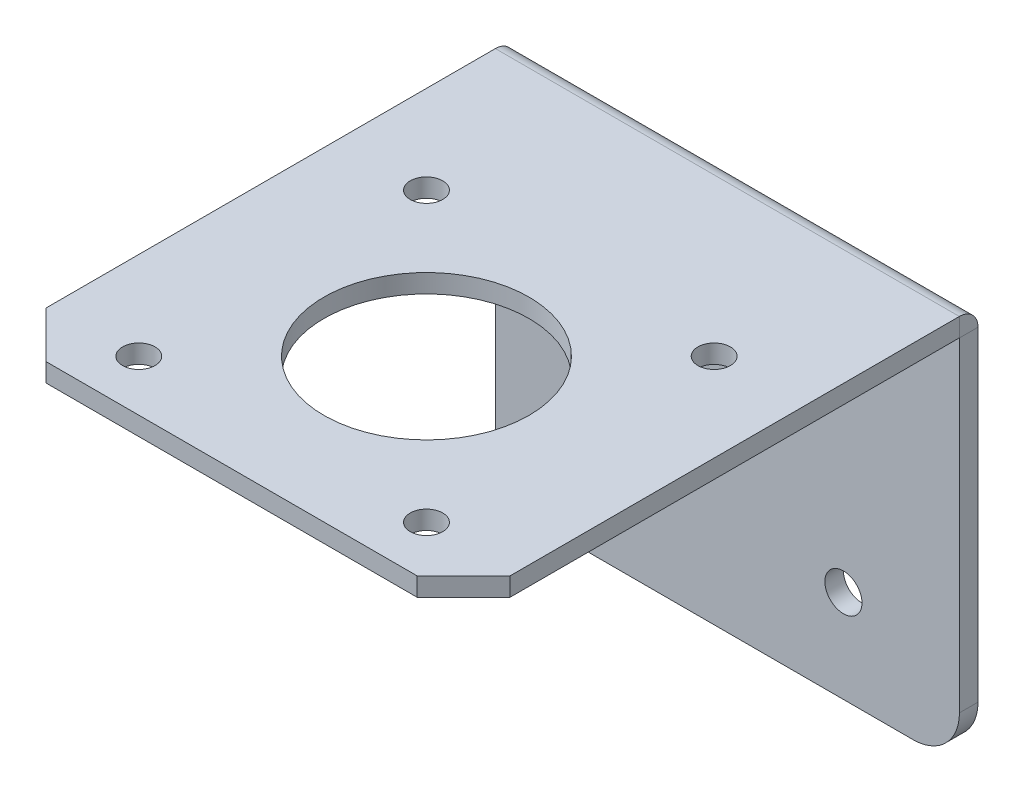
ISO-10303-21;
HEADER;
FILE_DESCRIPTION(('STEP AP214'),'2;1');
FILE_NAME('part.step','',(''),(''),'','','');
FILE_SCHEMA(('AUTOMOTIVE_DESIGN { 1 0 10303 214 1 1 1 1 }'));
ENDSEC;
DATA;
#1=APPLICATION_CONTEXT('core data for automotive mechanical design processes');
#2=APPLICATION_PROTOCOL_DEFINITION('international standard','automotive_design',2000,#1);
#3=PRODUCT_CONTEXT('',#1,'mechanical');
#4=PRODUCT('Part','Part','',(#3));
#5=PRODUCT_RELATED_PRODUCT_CATEGORY('part','',(#4));
#6=PRODUCT_DEFINITION_FORMATION('','',#4);
#7=PRODUCT_DEFINITION_CONTEXT('part definition',#1,'design');
#8=PRODUCT_DEFINITION('design','',#6,#7);
#9=PRODUCT_DEFINITION_SHAPE('','',#8);
#10=(LENGTH_UNIT() NAMED_UNIT(*) SI_UNIT(.MILLI.,.METRE.));
#11=(NAMED_UNIT(*) PLANE_ANGLE_UNIT() SI_UNIT($,.RADIAN.));
#12=(NAMED_UNIT(*) SI_UNIT($,.STERADIAN.) SOLID_ANGLE_UNIT());
#13=UNCERTAINTY_MEASURE_WITH_UNIT(LENGTH_MEASURE(1.E-05),#10,'distance_accuracy_value','');
#14=(GEOMETRIC_REPRESENTATION_CONTEXT(3) GLOBAL_UNCERTAINTY_ASSIGNED_CONTEXT((#13)) GLOBAL_UNIT_ASSIGNED_CONTEXT((#10,
#11,#12)) REPRESENTATION_CONTEXT('',''));
#15=CARTESIAN_POINT('',(0.,0.,0.));
#16=DIRECTION('',(0.,0.,1.));
#17=DIRECTION('',(1.,0.,0.));
#18=AXIS2_PLACEMENT_3D('',#15,#16,#17);
#19=CARTESIAN_POINT('',(20.,-7.49999999999986,-36.5665042900629));
#20=DIRECTION('',(0.,1.,0.));
#21=DIRECTION('',(-1.,0.,0.));
#22=AXIS2_PLACEMENT_3D('',#19,#20,#21);
#23=PLANE('',#22);
#24=CARTESIAN_POINT('',(15.5,-7.50000000000015,47.9334957099372));
#25=DIRECTION('',(0.,-1.,0.));
#26=DIRECTION('',(1.,0.,0.));
#27=AXIS2_PLACEMENT_3D('',#24,#25,#26);
#28=CIRCLE('',#27,1.75);
#29=CARTESIAN_POINT('',(17.25,-7.50000000000015,47.9334957099372));
#30=VERTEX_POINT('',#29);
#31=EDGE_CURVE('E241',#30,#30,#28,.T.);
#32=ORIENTED_EDGE('',*,*,#31,.F.);
#33=EDGE_LOOP('',(#32));
#34=FACE_BOUND('',#33,.T.);
#35=CARTESIAN_POINT('',(-15.5,-7.50000000000015,47.9334957099372));
#36=DIRECTION('',(0.,-1.,0.));
#37=DIRECTION('',(1.,0.,0.));
#38=AXIS2_PLACEMENT_3D('',#35,#36,#37);
#39=CIRCLE('',#38,1.75);
#40=CARTESIAN_POINT('',(-13.75,-7.50000000000015,47.9334957099372));
#41=VERTEX_POINT('',#40);
#42=EDGE_CURVE('E235',#41,#41,#39,.T.);
#43=ORIENTED_EDGE('',*,*,#42,.F.);
#44=EDGE_LOOP('',(#43));
#45=FACE_BOUND('',#44,.T.);
#46=CARTESIAN_POINT('',(15.5,-7.50000000000005,16.9334957099372));
#47=DIRECTION('',(0.,-1.,0.));
#48=DIRECTION('',(1.,0.,0.));
#49=AXIS2_PLACEMENT_3D('',#46,#47,#48);
#50=CIRCLE('',#49,1.75);
#51=CARTESIAN_POINT('',(17.25,-7.50000000000005,16.9334957099372));
#52=VERTEX_POINT('',#51);
#53=EDGE_CURVE('E229',#52,#52,#50,.T.);
#54=ORIENTED_EDGE('',*,*,#53,.F.);
#55=EDGE_LOOP('',(#54));
#56=FACE_BOUND('',#55,.T.);
#57=CARTESIAN_POINT('',(-15.5,-7.50000000000005,16.9334957099372));
#58=DIRECTION('',(0.,-1.,0.));
#59=DIRECTION('',(1.,0.,0.));
#60=AXIS2_PLACEMENT_3D('',#57,#58,#59);
#61=CIRCLE('',#60,1.75);
#62=CARTESIAN_POINT('',(-13.75,-7.50000000000005,16.9334957099372));
#63=VERTEX_POINT('',#62);
#64=EDGE_CURVE('E222',#63,#63,#61,.T.);
#65=ORIENTED_EDGE('',*,*,#64,.F.);
#66=EDGE_LOOP('',(#65));
#67=FACE_BOUND('',#66,.T.);
#68=CARTESIAN_POINT('',(0.,-7.5000000000001,32.4334957099372));
#69=DIRECTION('',(0.,-1.,0.));
#70=DIRECTION('',(1.,0.,0.));
#71=AXIS2_PLACEMENT_3D('',#68,#69,#70);
#72=CIRCLE('',#71,11.05);
#73=CARTESIAN_POINT('',(11.05,-7.5000000000001,32.4334957099372));
#74=VERTEX_POINT('',#73);
#75=EDGE_CURVE('E223',#74,#74,#72,.T.);
#76=ORIENTED_EDGE('',*,*,#75,.F.);
#77=EDGE_LOOP('',(#76));
#78=FACE_BOUND('',#77,.T.);
#79=DIRECTION('',(0.,0.,-1.));
#80=VECTOR('',#79,1.);
#81=CARTESIAN_POINT('',(-25.,-7.49999999999986,-36.5665042900628));
#82=LINE('',#81,#80);
#83=CARTESIAN_POINT('',(-25.,-7.50000000000016,48.4334957099371));
#84=VERTEX_POINT('',#83);
#85=CARTESIAN_POINT('',(-25.,-7.49999999999999,0.00999999999999265));
#86=VERTEX_POINT('',#85);
#87=EDGE_CURVE('E60',#84,#86,#82,.T.);
#88=ORIENTED_EDGE('',*,*,#87,.T.);
#89=DIRECTION('',(1.,0.,0.));
#90=VECTOR('',#89,1.);
#91=CARTESIAN_POINT('',(20.,-7.49999999999999,0.00999999999998571));
#92=LINE('',#91,#90);
#93=CARTESIAN_POINT('',(25.,-7.49999999999999,0.00999999999999265));
#94=VERTEX_POINT('',#93);
#95=EDGE_CURVE('E52',#86,#94,#92,.T.);
#96=ORIENTED_EDGE('',*,*,#95,.T.);
#97=DIRECTION('',(0.,0.,1.));
#98=VECTOR('',#97,1.);
#99=CARTESIAN_POINT('',(25.,-7.49999999999986,-36.5665042900628));
#100=LINE('',#99,#98);
#101=CARTESIAN_POINT('',(25.,-7.50000000000016,48.4334957099372));
#102=VERTEX_POINT('',#101);
#103=EDGE_CURVE('E68',#94,#102,#100,.T.);
#104=ORIENTED_EDGE('',*,*,#103,.T.);
#105=DIRECTION('',(-0.707106781186549,0.,0.707106781186546));
#106=VECTOR('',#105,1.);
#107=CARTESIAN_POINT('',(20.,-7.50000000000017,53.4334957099371));
#108=LINE('',#107,#106);
#109=CARTESIAN_POINT('',(20.,-7.50000000000017,53.4334957099371));
#110=VERTEX_POINT('',#109);
#111=EDGE_CURVE('E259',#102,#110,#108,.T.);
#112=ORIENTED_EDGE('',*,*,#111,.T.);
#113=DIRECTION('',(-1.,0.,0.));
#114=VECTOR('',#113,1.);
#115=CARTESIAN_POINT('',(-20.,-7.50000000000017,53.4334957099371));
#116=LINE('',#115,#114);
#117=CARTESIAN_POINT('',(-20.,-7.50000000000017,53.4334957099371));
#118=VERTEX_POINT('',#117);
#119=EDGE_CURVE('E262',#110,#118,#116,.T.);
#120=ORIENTED_EDGE('',*,*,#119,.T.);
#121=DIRECTION('',(-0.707106781186547,0.,-0.707106781186548));
#122=VECTOR('',#121,1.);
#123=CARTESIAN_POINT('',(-25.,-7.50000000000016,48.4334957099371));
#124=LINE('',#123,#122);
#125=EDGE_CURVE('E265',#118,#84,#124,.T.);
#126=ORIENTED_EDGE('',*,*,#125,.T.);
#127=EDGE_LOOP('',(#88,#96,#104,#112,#120,#126));
#128=FACE_BOUND('',#127,.T.);
#129=ADVANCED_FACE('F43',(#34,#45,#56,#67,#78,#128),#23,.F.);
#130=CARTESIAN_POINT('',(-25.,-5.49999999999986,-36.5665042900628));
#131=DIRECTION('',(-1.,0.,0.));
#132=DIRECTION('',(0.,0.,-1.));
#133=AXIS2_PLACEMENT_3D('',#130,#131,#132);
#134=PLANE('',#133);
#135=DIRECTION('',(0.,1.,0.));
#136=VECTOR('',#135,1.);
#137=CARTESIAN_POINT('',(-25.,-5.50000000000024,0.0100000000000065));
#138=LINE('',#137,#136);
#139=CARTESIAN_POINT('',(-25.,-5.49999999999999,0.0100000000000065));
#140=VERTEX_POINT('',#139);
#141=EDGE_CURVE('E12',#86,#140,#138,.T.);
#142=ORIENTED_EDGE('',*,*,#141,.F.);
#143=ORIENTED_EDGE('',*,*,#87,.F.);
#144=DIRECTION('',(0.,-1.,0.));
#145=VECTOR('',#144,1.);
#146=CARTESIAN_POINT('',(-25.,-5.50000000000016,48.4334957099371));
#147=LINE('',#146,#145);
#148=CARTESIAN_POINT('',(-25.,-5.50000000000016,48.4334957099371));
#149=VERTEX_POINT('',#148);
#150=EDGE_CURVE('E268',#149,#84,#147,.T.);
#151=ORIENTED_EDGE('',*,*,#150,.F.);
#152=DIRECTION('',(0.,0.,-1.));
#153=VECTOR('',#152,1.);
#154=CARTESIAN_POINT('',(-25.,-5.49999999999986,-36.5665042900628));
#155=LINE('',#154,#153);
#156=EDGE_CURVE('E267',#149,#140,#155,.T.);
#157=ORIENTED_EDGE('',*,*,#156,.T.);
#158=EDGE_LOOP('',(#142,#143,#151,#157));
#159=FACE_BOUND('',#158,.T.);
#160=ADVANCED_FACE('F45',(#159),#134,.T.);
#161=CARTESIAN_POINT('',(-25.,-5.50000000000016,48.4334957099371));
#162=DIRECTION('',(-0.707106781186548,0.,0.707106781186547));
#163=DIRECTION('',(-0.707106781186547,0.,-0.707106781186548));
#164=AXIS2_PLACEMENT_3D('',#161,#162,#163);
#165=PLANE('',#164);
#166=ORIENTED_EDGE('',*,*,#125,.F.);
#167=DIRECTION('',(0.,-1.,0.));
#168=VECTOR('',#167,1.);
#169=CARTESIAN_POINT('',(-20.,-5.50000000000017,53.4334957099371));
#170=LINE('',#169,#168);
#171=CARTESIAN_POINT('',(-20.,-5.50000000000017,53.4334957099371));
#172=VERTEX_POINT('',#171);
#173=EDGE_CURVE('E271',#172,#118,#170,.T.);
#174=ORIENTED_EDGE('',*,*,#173,.F.);
#175=DIRECTION('',(-0.707106781186547,0.,-0.707106781186548));
#176=VECTOR('',#175,1.);
#177=CARTESIAN_POINT('',(-25.,-5.50000000000016,48.4334957099371));
#178=LINE('',#177,#176);
#179=EDGE_CURVE('E255',#172,#149,#178,.T.);
#180=ORIENTED_EDGE('',*,*,#179,.T.);
#181=ORIENTED_EDGE('',*,*,#150,.T.);
#182=EDGE_LOOP('',(#166,#174,#180,#181));
#183=FACE_BOUND('',#182,.T.);
#184=ADVANCED_FACE('F297',(#183),#165,.T.);
#185=CARTESIAN_POINT('',(-20.,-5.50000000000017,53.4334957099371));
#186=DIRECTION('',(0.,0.,1.));
#187=DIRECTION('',(0.,-1.,0.));
#188=AXIS2_PLACEMENT_3D('',#185,#186,#187);
#189=PLANE('',#188);
#190=ORIENTED_EDGE('',*,*,#119,.F.);
#191=DIRECTION('',(0.,-1.,0.));
#192=VECTOR('',#191,1.);
#193=CARTESIAN_POINT('',(20.,-5.50000000000017,53.4334957099371));
#194=LINE('',#193,#192);
#195=CARTESIAN_POINT('',(20.,-5.50000000000017,53.4334957099371));
#196=VERTEX_POINT('',#195);
#197=EDGE_CURVE('E273',#196,#110,#194,.T.);
#198=ORIENTED_EDGE('',*,*,#197,.F.);
#199=DIRECTION('',(-1.,0.,0.));
#200=VECTOR('',#199,1.);
#201=CARTESIAN_POINT('',(-20.,-5.50000000000017,53.4334957099371));
#202=LINE('',#201,#200);
#203=EDGE_CURVE('E252',#196,#172,#202,.T.);
#204=ORIENTED_EDGE('',*,*,#203,.T.);
#205=ORIENTED_EDGE('',*,*,#173,.T.);
#206=EDGE_LOOP('',(#190,#198,#204,#205));
#207=FACE_BOUND('',#206,.T.);
#208=ADVANCED_FACE('F294',(#207),#189,.T.);
#209=CARTESIAN_POINT('',(20.,-5.50000000000017,53.4334957099371));
#210=DIRECTION('',(0.707106781186546,0.,0.707106781186549));
#211=DIRECTION('',(-0.707106781186549,0.,0.707106781186546));
#212=AXIS2_PLACEMENT_3D('',#209,#210,#211);
#213=PLANE('',#212);
#214=ORIENTED_EDGE('',*,*,#111,.F.);
#215=DIRECTION('',(0.,-1.,0.));
#216=VECTOR('',#215,1.);
#217=CARTESIAN_POINT('',(25.,-5.50000000000016,48.4334957099372));
#218=LINE('',#217,#216);
#219=CARTESIAN_POINT('',(25.,-5.50000000000016,48.4334957099372));
#220=VERTEX_POINT('',#219);
#221=EDGE_CURVE('E258',#220,#102,#218,.T.);
#222=ORIENTED_EDGE('',*,*,#221,.F.);
#223=DIRECTION('',(-0.707106781186549,0.,0.707106781186546));
#224=VECTOR('',#223,1.);
#225=CARTESIAN_POINT('',(20.,-5.50000000000017,53.4334957099371));
#226=LINE('',#225,#224);
#227=EDGE_CURVE('E249',#220,#196,#226,.T.);
#228=ORIENTED_EDGE('',*,*,#227,.T.);
#229=ORIENTED_EDGE('',*,*,#197,.T.);
#230=EDGE_LOOP('',(#214,#222,#228,#229));
#231=FACE_BOUND('',#230,.T.);
#232=ADVANCED_FACE('F290',(#231),#213,.T.);
#233=CARTESIAN_POINT('',(25.,-5.49999999999986,-36.5665042900628));
#234=DIRECTION('',(1.,0.,0.));
#235=DIRECTION('',(0.,1.,0.));
#236=AXIS2_PLACEMENT_3D('',#233,#234,#235);
#237=PLANE('',#236);
#238=DIRECTION('',(0.,-1.,0.));
#239=VECTOR('',#238,1.);
#240=CARTESIAN_POINT('',(25.,-5.50000000000024,0.0100000000000065));
#241=LINE('',#240,#239);
#242=CARTESIAN_POINT('',(25.,-5.49999999999998,0.00999999999999699));
#243=VERTEX_POINT('',#242);
#244=EDGE_CURVE('E277',#243,#94,#241,.T.);
#245=ORIENTED_EDGE('',*,*,#244,.F.);
#246=DIRECTION('',(0.,0.,1.));
#247=VECTOR('',#246,1.);
#248=CARTESIAN_POINT('',(25.,-5.49999999999986,-36.5665042900628));
#249=LINE('',#248,#247);
#250=EDGE_CURVE('E47',#243,#220,#249,.T.);
#251=ORIENTED_EDGE('',*,*,#250,.T.);
#252=ORIENTED_EDGE('',*,*,#221,.T.);
#253=ORIENTED_EDGE('',*,*,#103,.F.);
#254=EDGE_LOOP('',(#245,#251,#252,#253));
#255=FACE_BOUND('',#254,.T.);
#256=ADVANCED_FACE('F286',(#255),#237,.T.);
#257=CARTESIAN_POINT('',(20.,-5.49999999999986,-36.5665042900629));
#258=DIRECTION('',(0.,1.,0.));
#259=DIRECTION('',(-1.,0.,0.));
#260=AXIS2_PLACEMENT_3D('',#257,#258,#259);
#261=PLANE('',#260);
#262=DIRECTION('',(1.,0.,0.));
#263=VECTOR('',#262,1.);
#264=CARTESIAN_POINT('',(20.,-5.49999999999999,0.0100000000000065));
#265=LINE('',#264,#263);
#266=EDGE_CURVE('E270',#140,#243,#265,.T.);
#267=ORIENTED_EDGE('',*,*,#266,.F.);
#268=ORIENTED_EDGE('',*,*,#156,.F.);
#269=ORIENTED_EDGE('',*,*,#179,.F.);
#270=ORIENTED_EDGE('',*,*,#203,.F.);
#271=ORIENTED_EDGE('',*,*,#227,.F.);
#272=ORIENTED_EDGE('',*,*,#250,.F.);
#273=EDGE_LOOP('',(#267,#268,#269,#270,#271,#272));
#274=FACE_BOUND('',#273,.T.);
#275=CARTESIAN_POINT('',(0.,-5.5000000000001,32.4334957099372));
#276=DIRECTION('',(0.,-1.,0.));
#277=DIRECTION('',(1.,0.,0.));
#278=AXIS2_PLACEMENT_3D('',#275,#276,#277);
#279=CIRCLE('',#278,11.05);
#280=CARTESIAN_POINT('',(11.05,-5.5000000000001,32.4334957099372));
#281=VERTEX_POINT('',#280);
#282=EDGE_CURVE('E219',#281,#281,#279,.T.);
#283=ORIENTED_EDGE('',*,*,#282,.T.);
#284=EDGE_LOOP('',(#283));
#285=FACE_BOUND('',#284,.T.);
#286=CARTESIAN_POINT('',(-15.5,-5.50000000000005,16.9334957099372));
#287=DIRECTION('',(0.,-1.,0.));
#288=DIRECTION('',(1.,0.,0.));
#289=AXIS2_PLACEMENT_3D('',#286,#287,#288);
#290=CIRCLE('',#289,1.75);
#291=CARTESIAN_POINT('',(-13.75,-5.50000000000005,16.9334957099372));
#292=VERTEX_POINT('',#291);
#293=EDGE_CURVE('E226',#292,#292,#290,.T.);
#294=ORIENTED_EDGE('',*,*,#293,.T.);
#295=EDGE_LOOP('',(#294));
#296=FACE_BOUND('',#295,.T.);
#297=CARTESIAN_POINT('',(15.5,-5.50000000000005,16.9334957099372));
#298=DIRECTION('',(0.,-1.,0.));
#299=DIRECTION('',(1.,0.,0.));
#300=AXIS2_PLACEMENT_3D('',#297,#298,#299);
#301=CIRCLE('',#300,1.75);
#302=CARTESIAN_POINT('',(17.25,-5.50000000000005,16.9334957099372));
#303=VERTEX_POINT('',#302);
#304=EDGE_CURVE('E232',#303,#303,#301,.T.);
#305=ORIENTED_EDGE('',*,*,#304,.T.);
#306=EDGE_LOOP('',(#305));
#307=FACE_BOUND('',#306,.T.);
#308=CARTESIAN_POINT('',(-15.5,-5.50000000000015,47.9334957099372));
#309=DIRECTION('',(0.,-1.,0.));
#310=DIRECTION('',(1.,0.,0.));
#311=AXIS2_PLACEMENT_3D('',#308,#309,#310);
#312=CIRCLE('',#311,1.75);
#313=CARTESIAN_POINT('',(-13.75,-5.50000000000015,47.9334957099372));
#314=VERTEX_POINT('',#313);
#315=EDGE_CURVE('E238',#314,#314,#312,.T.);
#316=ORIENTED_EDGE('',*,*,#315,.T.);
#317=EDGE_LOOP('',(#316));
#318=FACE_BOUND('',#317,.T.);
#319=CARTESIAN_POINT('',(15.5,-5.50000000000015,47.9334957099372));
#320=DIRECTION('',(0.,-1.,0.));
#321=DIRECTION('',(1.,0.,0.));
#322=AXIS2_PLACEMENT_3D('',#319,#320,#321);
#323=CIRCLE('',#322,1.75);
#324=CARTESIAN_POINT('',(17.25,-5.50000000000015,47.9334957099372));
#325=VERTEX_POINT('',#324);
#326=EDGE_CURVE('E244',#325,#325,#323,.T.);
#327=ORIENTED_EDGE('',*,*,#326,.T.);
#328=EDGE_LOOP('',(#327));
#329=FACE_BOUND('',#328,.T.);
#330=ADVANCED_FACE('F320',(#274,#285,#296,#307,#318,#329),#261,.T.);
#331=CARTESIAN_POINT('',(15.5,-5.50000000000015,47.9334957099372));
#332=DIRECTION('',(0.,-1.,0.));
#333=DIRECTION('',(1.,0.,0.));
#334=AXIS2_PLACEMENT_3D('',#331,#332,#333);
#335=CYLINDRICAL_SURFACE('',#334,1.75);
#336=ORIENTED_EDGE('',*,*,#326,.F.);
#337=EDGE_LOOP('',(#336));
#338=FACE_BOUND('',#337,.T.);
#339=ORIENTED_EDGE('',*,*,#31,.T.);
#340=EDGE_LOOP('',(#339));
#341=FACE_BOUND('',#340,.T.);
#342=ADVANCED_FACE('F323',(#338,#341),#335,.F.);
#343=CARTESIAN_POINT('',(-15.5,-5.50000000000015,47.9334957099372));
#344=DIRECTION('',(0.,-1.,0.));
#345=DIRECTION('',(1.,0.,0.));
#346=AXIS2_PLACEMENT_3D('',#343,#344,#345);
#347=CYLINDRICAL_SURFACE('',#346,1.75);
#348=ORIENTED_EDGE('',*,*,#315,.F.);
#349=EDGE_LOOP('',(#348));
#350=FACE_BOUND('',#349,.T.);
#351=ORIENTED_EDGE('',*,*,#42,.T.);
#352=EDGE_LOOP('',(#351));
#353=FACE_BOUND('',#352,.T.);
#354=ADVANCED_FACE('F337',(#350,#353),#347,.F.);
#355=CARTESIAN_POINT('',(15.5,-5.50000000000005,16.9334957099372));
#356=DIRECTION('',(0.,-1.,0.));
#357=DIRECTION('',(1.,0.,0.));
#358=AXIS2_PLACEMENT_3D('',#355,#356,#357);
#359=CYLINDRICAL_SURFACE('',#358,1.75);
#360=ORIENTED_EDGE('',*,*,#304,.F.);
#361=EDGE_LOOP('',(#360));
#362=FACE_BOUND('',#361,.T.);
#363=ORIENTED_EDGE('',*,*,#53,.T.);
#364=EDGE_LOOP('',(#363));
#365=FACE_BOUND('',#364,.T.);
#366=ADVANCED_FACE('F362',(#362,#365),#359,.F.);
#367=CARTESIAN_POINT('',(-15.5,-5.50000000000005,16.9334957099372));
#368=DIRECTION('',(0.,-1.,0.));
#369=DIRECTION('',(1.,0.,0.));
#370=AXIS2_PLACEMENT_3D('',#367,#368,#369);
#371=CYLINDRICAL_SURFACE('',#370,1.75);
#372=ORIENTED_EDGE('',*,*,#293,.F.);
#373=EDGE_LOOP('',(#372));
#374=FACE_BOUND('',#373,.T.);
#375=ORIENTED_EDGE('',*,*,#64,.T.);
#376=EDGE_LOOP('',(#375));
#377=FACE_BOUND('',#376,.T.);
#378=ADVANCED_FACE('F353',(#374,#377),#371,.F.);
#379=CARTESIAN_POINT('',(0.,-5.5000000000001,32.4334957099372));
#380=DIRECTION('',(0.,-1.,0.));
#381=DIRECTION('',(1.,0.,0.));
#382=AXIS2_PLACEMENT_3D('',#379,#380,#381);
#383=CYLINDRICAL_SURFACE('',#382,11.05);
#384=ORIENTED_EDGE('',*,*,#282,.F.);
#385=EDGE_LOOP('',(#384));
#386=FACE_BOUND('',#385,.T.);
#387=ORIENTED_EDGE('',*,*,#75,.T.);
#388=EDGE_LOOP('',(#387));
#389=FACE_BOUND('',#388,.T.);
#390=ADVANCED_FACE('F351',(#386,#389),#383,.F.);
#391=CARTESIAN_POINT('',(-20.,-42.5,-2.));
#392=DIRECTION('',(0.,0.,1.));
#393=DIRECTION('',(1.,0.,0.));
#394=AXIS2_PLACEMENT_3D('',#391,#392,#393);
#395=CYLINDRICAL_SURFACE('',#394,5.);
#396=CARTESIAN_POINT('',(-20.,-42.5,0.));
#397=DIRECTION('',(0.,0.,1.));
#398=DIRECTION('',(1.,0.,0.));
#399=AXIS2_PLACEMENT_3D('',#396,#397,#398);
#400=CIRCLE('',#399,5.);
#401=CARTESIAN_POINT('',(-25.,-42.5,0.));
#402=VERTEX_POINT('',#401);
#403=CARTESIAN_POINT('',(-20.,-47.5,0.));
#404=VERTEX_POINT('',#403);
#405=EDGE_CURVE('E185',#402,#404,#400,.T.);
#406=ORIENTED_EDGE('',*,*,#405,.F.);
#407=DIRECTION('',(0.,0.,1.));
#408=VECTOR('',#407,1.);
#409=CARTESIAN_POINT('',(-25.,-42.5,-2.));
#410=LINE('',#409,#408);
#411=CARTESIAN_POINT('',(-25.,-42.5,-2.));
#412=VERTEX_POINT('',#411);
#413=EDGE_CURVE('E167',#412,#402,#410,.T.);
#414=ORIENTED_EDGE('',*,*,#413,.F.);
#415=CARTESIAN_POINT('',(-20.,-42.5,-2.));
#416=DIRECTION('',(0.,0.,1.));
#417=DIRECTION('',(1.,0.,0.));
#418=AXIS2_PLACEMENT_3D('',#415,#416,#417);
#419=CIRCLE('',#418,5.);
#420=CARTESIAN_POINT('',(-20.,-47.5,-2.));
#421=VERTEX_POINT('',#420);
#422=EDGE_CURVE('E163',#412,#421,#419,.T.);
#423=ORIENTED_EDGE('',*,*,#422,.T.);
#424=DIRECTION('',(0.,0.,1.));
#425=VECTOR('',#424,1.);
#426=CARTESIAN_POINT('',(-20.,-47.5,-2.));
#427=LINE('',#426,#425);
#428=EDGE_CURVE('E214',#421,#404,#427,.T.);
#429=ORIENTED_EDGE('',*,*,#428,.T.);
#430=EDGE_LOOP('',(#406,#414,#423,#429));
#431=FACE_BOUND('',#430,.T.);
#432=ADVANCED_FACE('F311',(#431),#395,.T.);
#433=CARTESIAN_POINT('',(-20.,-47.5,-2.));
#434=DIRECTION('',(0.,-1.,0.));
#435=DIRECTION('',(0.,0.,-1.));
#436=AXIS2_PLACEMENT_3D('',#433,#434,#435);
#437=PLANE('',#436);
#438=DIRECTION('',(1.,0.,0.));
#439=VECTOR('',#438,1.);
#440=CARTESIAN_POINT('',(-20.,-47.5,0.));
#441=LINE('',#440,#439);
#442=CARTESIAN_POINT('',(20.,-47.5,0.));
#443=VERTEX_POINT('',#442);
#444=EDGE_CURVE('E182',#404,#443,#441,.T.);
#445=ORIENTED_EDGE('',*,*,#444,.F.);
#446=ORIENTED_EDGE('',*,*,#428,.F.);
#447=DIRECTION('',(1.,0.,0.));
#448=VECTOR('',#447,1.);
#449=CARTESIAN_POINT('',(-20.,-47.5,-2.));
#450=LINE('',#449,#448);
#451=CARTESIAN_POINT('',(20.,-47.5,-2.));
#452=VERTEX_POINT('',#451);
#453=EDGE_CURVE('E211',#421,#452,#450,.T.);
#454=ORIENTED_EDGE('',*,*,#453,.T.);
#455=DIRECTION('',(0.,0.,1.));
#456=VECTOR('',#455,1.);
#457=CARTESIAN_POINT('',(20.,-47.5,-2.));
#458=LINE('',#457,#456);
#459=EDGE_CURVE('E209',#452,#443,#458,.T.);
#460=ORIENTED_EDGE('',*,*,#459,.T.);
#461=EDGE_LOOP('',(#445,#446,#454,#460));
#462=FACE_BOUND('',#461,.T.);
#463=ADVANCED_FACE('F360',(#462),#437,.T.);
#464=CARTESIAN_POINT('',(20.,-42.5,-2.));
#465=DIRECTION('',(0.,0.,1.));
#466=DIRECTION('',(1.,0.,0.));
#467=AXIS2_PLACEMENT_3D('',#464,#465,#466);
#468=CYLINDRICAL_SURFACE('',#467,5.);
#469=CARTESIAN_POINT('',(20.,-42.5,0.));
#470=DIRECTION('',(0.,0.,1.));
#471=DIRECTION('',(-1.,0.,0.));
#472=AXIS2_PLACEMENT_3D('',#469,#470,#471);
#473=CIRCLE('',#472,5.);
#474=CARTESIAN_POINT('',(25.,-42.5,0.));
#475=VERTEX_POINT('',#474);
#476=EDGE_CURVE('E176',#443,#475,#473,.T.);
#477=ORIENTED_EDGE('',*,*,#476,.F.);
#478=ORIENTED_EDGE('',*,*,#459,.F.);
#479=CARTESIAN_POINT('',(20.,-42.5,-2.));
#480=DIRECTION('',(0.,0.,1.));
#481=DIRECTION('',(-1.,0.,0.));
#482=AXIS2_PLACEMENT_3D('',#479,#480,#481);
#483=CIRCLE('',#482,5.);
#484=CARTESIAN_POINT('',(25.,-42.5,-2.));
#485=VERTEX_POINT('',#484);
#486=EDGE_CURVE('E206',#452,#485,#483,.T.);
#487=ORIENTED_EDGE('',*,*,#486,.T.);
#488=DIRECTION('',(0.,0.,1.));
#489=VECTOR('',#488,1.);
#490=CARTESIAN_POINT('',(25.,-42.5,-2.));
#491=LINE('',#490,#489);
#492=EDGE_CURVE('E204',#485,#475,#491,.T.);
#493=ORIENTED_EDGE('',*,*,#492,.T.);
#494=EDGE_LOOP('',(#477,#478,#487,#493));
#495=FACE_BOUND('',#494,.T.);
#496=ADVANCED_FACE('F428',(#495),#468,.T.);
#497=CARTESIAN_POINT('',(12.5,-37.5,-2.));
#498=DIRECTION('',(0.,0.,1.));
#499=DIRECTION('',(1.,0.,0.));
#500=AXIS2_PLACEMENT_3D('',#497,#498,#499);
#501=CYLINDRICAL_SURFACE('',#500,2.);
#502=CARTESIAN_POINT('',(12.5,-37.5,-2.));
#503=DIRECTION('',(0.,0.,1.));
#504=DIRECTION('',(1.,0.,0.));
#505=AXIS2_PLACEMENT_3D('',#502,#503,#504);
#506=CIRCLE('',#505,2.);
#507=CARTESIAN_POINT('',(14.5,-37.5,-2.));
#508=VERTEX_POINT('',#507);
#509=EDGE_CURVE('E156',#508,#508,#506,.T.);
#510=ORIENTED_EDGE('',*,*,#509,.F.);
#511=EDGE_LOOP('',(#510));
#512=FACE_BOUND('',#511,.T.);
#513=CARTESIAN_POINT('',(12.5,-37.5,0.));
#514=DIRECTION('',(0.,0.,1.));
#515=DIRECTION('',(1.,0.,0.));
#516=AXIS2_PLACEMENT_3D('',#513,#514,#515);
#517=CIRCLE('',#516,2.);
#518=CARTESIAN_POINT('',(14.5,-37.5,0.));
#519=VERTEX_POINT('',#518);
#520=EDGE_CURVE('E201',#519,#519,#517,.T.);
#521=ORIENTED_EDGE('',*,*,#520,.T.);
#522=EDGE_LOOP('',(#521));
#523=FACE_BOUND('',#522,.T.);
#524=ADVANCED_FACE('F439',(#512,#523),#501,.F.);
#525=CARTESIAN_POINT('',(-12.5,-37.5,-2.));
#526=DIRECTION('',(0.,0.,1.));
#527=DIRECTION('',(1.,0.,0.));
#528=AXIS2_PLACEMENT_3D('',#525,#526,#527);
#529=CYLINDRICAL_SURFACE('',#528,2.);
#530=CARTESIAN_POINT('',(-12.5,-37.5,-2.));
#531=DIRECTION('',(0.,0.,1.));
#532=DIRECTION('',(1.,0.,0.));
#533=AXIS2_PLACEMENT_3D('',#530,#531,#532);
#534=CIRCLE('',#533,2.);
#535=CARTESIAN_POINT('',(-10.5,-37.5,-2.));
#536=VERTEX_POINT('',#535);
#537=EDGE_CURVE('E195',#536,#536,#534,.T.);
#538=ORIENTED_EDGE('',*,*,#537,.F.);
#539=EDGE_LOOP('',(#538));
#540=FACE_BOUND('',#539,.T.);
#541=CARTESIAN_POINT('',(-12.5,-37.5,0.));
#542=DIRECTION('',(0.,0.,1.));
#543=DIRECTION('',(1.,0.,0.));
#544=AXIS2_PLACEMENT_3D('',#541,#542,#543);
#545=CIRCLE('',#544,2.);
#546=CARTESIAN_POINT('',(-10.5,-37.5,0.));
#547=VERTEX_POINT('',#546);
#548=EDGE_CURVE('E198',#547,#547,#545,.T.);
#549=ORIENTED_EDGE('',*,*,#548,.T.);
#550=EDGE_LOOP('',(#549));
#551=FACE_BOUND('',#550,.T.);
#552=ADVANCED_FACE('F450',(#540,#551),#529,.F.);
#553=CARTESIAN_POINT('',(20.,-42.5,-2.));
#554=DIRECTION('',(0.,0.,-1.));
#555=DIRECTION('',(-1.,0.,0.));
#556=AXIS2_PLACEMENT_3D('',#553,#554,#555);
#557=PLANE('',#556);
#558=ORIENTED_EDGE('',*,*,#537,.T.);
#559=EDGE_LOOP('',(#558));
#560=FACE_BOUND('',#559,.T.);
#561=ORIENTED_EDGE('',*,*,#509,.T.);
#562=EDGE_LOOP('',(#561));
#563=FACE_BOUND('',#562,.T.);
#564=DIRECTION('',(0.,-1.,0.));
#565=VECTOR('',#564,1.);
#566=CARTESIAN_POINT('',(-25.,-42.5,-2.));
#567=LINE('',#566,#565);
#568=CARTESIAN_POINT('',(-25.,-7.50999999999998,-2.));
#569=VERTEX_POINT('',#568);
#570=EDGE_CURVE('E159',#569,#412,#567,.T.);
#571=ORIENTED_EDGE('',*,*,#570,.F.);
#572=DIRECTION('',(1.,0.,0.));
#573=VECTOR('',#572,1.);
#574=CARTESIAN_POINT('',(20.,-7.50999999999998,-2.));
#575=LINE('',#574,#573);
#576=CARTESIAN_POINT('',(25.,-7.50999999999998,-2.));
#577=VERTEX_POINT('',#576);
#578=EDGE_CURVE('E148',#569,#577,#575,.T.);
#579=ORIENTED_EDGE('',*,*,#578,.T.);
#580=DIRECTION('',(0.,1.,0.));
#581=VECTOR('',#580,1.);
#582=CARTESIAN_POINT('',(25.,-42.5,-2.));
#583=LINE('',#582,#581);
#584=EDGE_CURVE('E155',#485,#577,#583,.T.);
#585=ORIENTED_EDGE('',*,*,#584,.F.);
#586=ORIENTED_EDGE('',*,*,#486,.F.);
#587=ORIENTED_EDGE('',*,*,#453,.F.);
#588=ORIENTED_EDGE('',*,*,#422,.F.);
#589=EDGE_LOOP('',(#571,#579,#585,#586,#587,#588));
#590=FACE_BOUND('',#589,.T.);
#591=ADVANCED_FACE('F160',(#560,#563,#590),#557,.T.);
#592=CARTESIAN_POINT('',(25.,-42.5,-2.));
#593=DIRECTION('',(1.,0.,0.));
#594=DIRECTION('',(0.,0.,-1.));
#595=AXIS2_PLACEMENT_3D('',#592,#593,#594);
#596=PLANE('',#595);
#597=ORIENTED_EDGE('',*,*,#584,.T.);
#598=DIRECTION('',(0.,0.,1.));
#599=VECTOR('',#598,1.);
#600=CARTESIAN_POINT('',(25.,-7.50999999999999,-1.99999999999976));
#601=LINE('',#600,#599);
#602=CARTESIAN_POINT('',(25.,-7.51,0.));
#603=VERTEX_POINT('',#602);
#604=EDGE_CURVE('E189',#577,#603,#601,.T.);
#605=ORIENTED_EDGE('',*,*,#604,.T.);
#606=DIRECTION('',(0.,1.,0.));
#607=VECTOR('',#606,1.);
#608=CARTESIAN_POINT('',(25.,-42.5,0.));
#609=LINE('',#608,#607);
#610=EDGE_CURVE('E173',#475,#603,#609,.T.);
#611=ORIENTED_EDGE('',*,*,#610,.F.);
#612=ORIENTED_EDGE('',*,*,#492,.F.);
#613=EDGE_LOOP('',(#597,#605,#611,#612));
#614=FACE_BOUND('',#613,.T.);
#615=ADVANCED_FACE('F472',(#614),#596,.T.);
#616=CARTESIAN_POINT('',(20.,-42.5,0.));
#617=DIRECTION('',(0.,0.,-1.));
#618=DIRECTION('',(-1.,0.,0.));
#619=AXIS2_PLACEMENT_3D('',#616,#617,#618);
#620=PLANE('',#619);
#621=DIRECTION('',(1.,0.,0.));
#622=VECTOR('',#621,1.);
#623=CARTESIAN_POINT('',(20.,-7.51,0.));
#624=LINE('',#623,#622);
#625=CARTESIAN_POINT('',(-25.,-7.50999999999998,0.));
#626=VERTEX_POINT('',#625);
#627=EDGE_CURVE('E217',#626,#603,#624,.T.);
#628=ORIENTED_EDGE('',*,*,#627,.F.);
#629=DIRECTION('',(0.,-1.,0.));
#630=VECTOR('',#629,1.);
#631=CARTESIAN_POINT('',(-25.,-42.5,0.));
#632=LINE('',#631,#630);
#633=EDGE_CURVE('E171',#626,#402,#632,.T.);
#634=ORIENTED_EDGE('',*,*,#633,.T.);
#635=ORIENTED_EDGE('',*,*,#405,.T.);
#636=ORIENTED_EDGE('',*,*,#444,.T.);
#637=ORIENTED_EDGE('',*,*,#476,.T.);
#638=ORIENTED_EDGE('',*,*,#610,.T.);
#639=EDGE_LOOP('',(#628,#634,#635,#636,#637,#638));
#640=FACE_BOUND('',#639,.T.);
#641=ORIENTED_EDGE('',*,*,#520,.F.);
#642=EDGE_LOOP('',(#641));
#643=FACE_BOUND('',#642,.T.);
#644=ORIENTED_EDGE('',*,*,#548,.F.);
#645=EDGE_LOOP('',(#644));
#646=FACE_BOUND('',#645,.T.);
#647=ADVANCED_FACE('F314',(#640,#643,#646),#620,.F.);
#648=CARTESIAN_POINT('',(-25.,-42.5,-2.));
#649=DIRECTION('',(-1.,0.,0.));
#650=DIRECTION('',(0.,-1.,0.));
#651=AXIS2_PLACEMENT_3D('',#648,#649,#650);
#652=PLANE('',#651);
#653=ORIENTED_EDGE('',*,*,#633,.F.);
#654=DIRECTION('',(0.,0.,-1.));
#655=VECTOR('',#654,1.);
#656=CARTESIAN_POINT('',(-25.,-7.50999999999999,-1.99999999999976));
#657=LINE('',#656,#655);
#658=EDGE_CURVE('E139',#626,#569,#657,.T.);
#659=ORIENTED_EDGE('',*,*,#658,.T.);
#660=ORIENTED_EDGE('',*,*,#570,.T.);
#661=ORIENTED_EDGE('',*,*,#413,.T.);
#662=EDGE_LOOP('',(#653,#659,#660,#661));
#663=FACE_BOUND('',#662,.T.);
#664=ADVANCED_FACE('F170',(#663),#652,.T.);
#665=CARTESIAN_POINT('',(-25.,-7.50999999999998,0.01));
#666=DIRECTION('',(-1.,0.,0.));
#667=DIRECTION('',(0.,0.,1.));
#668=AXIS2_PLACEMENT_3D('',#665,#666,#667);
#669=PLANE('',#668);
#670=ORIENTED_EDGE('',*,*,#658,.F.);
#671=CARTESIAN_POINT('',(-25.,-7.50999999999998,0.01));
#672=DIRECTION('',(1.,0.,0.));
#673=DIRECTION('',(0.,0.,-1.));
#674=AXIS2_PLACEMENT_3D('',#671,#672,#673);
#675=CIRCLE('',#674,0.01);
#676=EDGE_CURVE('E304',#626,#86,#675,.T.);
#677=ORIENTED_EDGE('',*,*,#676,.T.);
#678=ORIENTED_EDGE('',*,*,#141,.T.);
#679=CARTESIAN_POINT('',(-25.,-7.50999999999998,0.01));
#680=DIRECTION('',(1.,0.,0.));
#681=DIRECTION('',(0.,0.,1.));
#682=AXIS2_PLACEMENT_3D('',#679,#680,#681);
#683=CIRCLE('',#682,2.01);
#684=EDGE_CURVE('E134',#569,#140,#683,.T.);
#685=ORIENTED_EDGE('',*,*,#684,.F.);
#686=EDGE_LOOP('',(#670,#677,#678,#685));
#687=FACE_BOUND('',#686,.T.);
#688=ADVANCED_FACE('F136',(#687),#669,.T.);
#689=CARTESIAN_POINT('',(25.,-7.50999999999998,0.01));
#690=DIRECTION('',(1.,0.,0.));
#691=DIRECTION('',(0.,0.,-1.));
#692=AXIS2_PLACEMENT_3D('',#689,#690,#691);
#693=PLANE('',#692);
#694=ORIENTED_EDGE('',*,*,#244,.T.);
#695=CARTESIAN_POINT('',(25.,-7.50999999999998,0.01));
#696=DIRECTION('',(1.,0.,0.));
#697=DIRECTION('',(0.,0.,-1.));
#698=AXIS2_PLACEMENT_3D('',#695,#696,#697);
#699=CIRCLE('',#698,0.01);
#700=EDGE_CURVE('E144',#94,#603,#699,.F.);
#701=ORIENTED_EDGE('',*,*,#700,.T.);
#702=ORIENTED_EDGE('',*,*,#604,.F.);
#703=CARTESIAN_POINT('',(25.,-7.50999999999998,0.01));
#704=DIRECTION('',(-1.,0.,0.));
#705=DIRECTION('',(0.,0.,-1.));
#706=AXIS2_PLACEMENT_3D('',#703,#704,#705);
#707=CIRCLE('',#706,2.01);
#708=EDGE_CURVE('E143',#243,#577,#707,.T.);
#709=ORIENTED_EDGE('',*,*,#708,.F.);
#710=EDGE_LOOP('',(#694,#701,#702,#709));
#711=FACE_BOUND('',#710,.T.);
#712=ADVANCED_FACE('F318',(#711),#693,.T.);
#713=CARTESIAN_POINT('',(-50.0651275426557,-7.50999999999998,0.01));
#714=DIRECTION('',(1.,0.,0.));
#715=DIRECTION('',(0.,0.,-1.));
#716=AXIS2_PLACEMENT_3D('',#713,#714,#715);
#717=CYLINDRICAL_SURFACE('',#716,2.01);
#718=ORIENTED_EDGE('',*,*,#708,.T.);
#719=ORIENTED_EDGE('',*,*,#578,.F.);
#720=ORIENTED_EDGE('',*,*,#684,.T.);
#721=ORIENTED_EDGE('',*,*,#266,.T.);
#722=EDGE_LOOP('',(#718,#719,#720,#721));
#723=FACE_BOUND('',#722,.T.);
#724=ADVANCED_FACE('F150',(#723),#717,.T.);
#725=CARTESIAN_POINT('',(-50.0651275426557,-7.50999999999998,0.01));
#726=DIRECTION('',(1.,0.,0.));
#727=DIRECTION('',(0.,0.,-1.));
#728=AXIS2_PLACEMENT_3D('',#725,#726,#727);
#729=CYLINDRICAL_SURFACE('',#728,0.01);
#730=ORIENTED_EDGE('',*,*,#700,.F.);
#731=ORIENTED_EDGE('',*,*,#95,.F.);
#732=ORIENTED_EDGE('',*,*,#676,.F.);
#733=ORIENTED_EDGE('',*,*,#627,.T.);
#734=EDGE_LOOP('',(#730,#731,#732,#733));
#735=FACE_BOUND('',#734,.T.);
#736=ADVANCED_FACE('F303',(#735),#729,.F.);
#737=CLOSED_SHELL('',(#129,#160,#184,#208,#232,#256,#330,#342,#354,#366,#378,#390,#432,#463,
#496,#524,#552,#591,#615,#647,#664,#688,#712,#724,#736));
#738=MANIFOLD_SOLID_BREP('B2',#737);
#739=ADVANCED_BREP_SHAPE_REPRESENTATION('',(#18,#738),#14);
#740=SHAPE_DEFINITION_REPRESENTATION(#9,#739);
ENDSEC;
END-ISO-10303-21;
